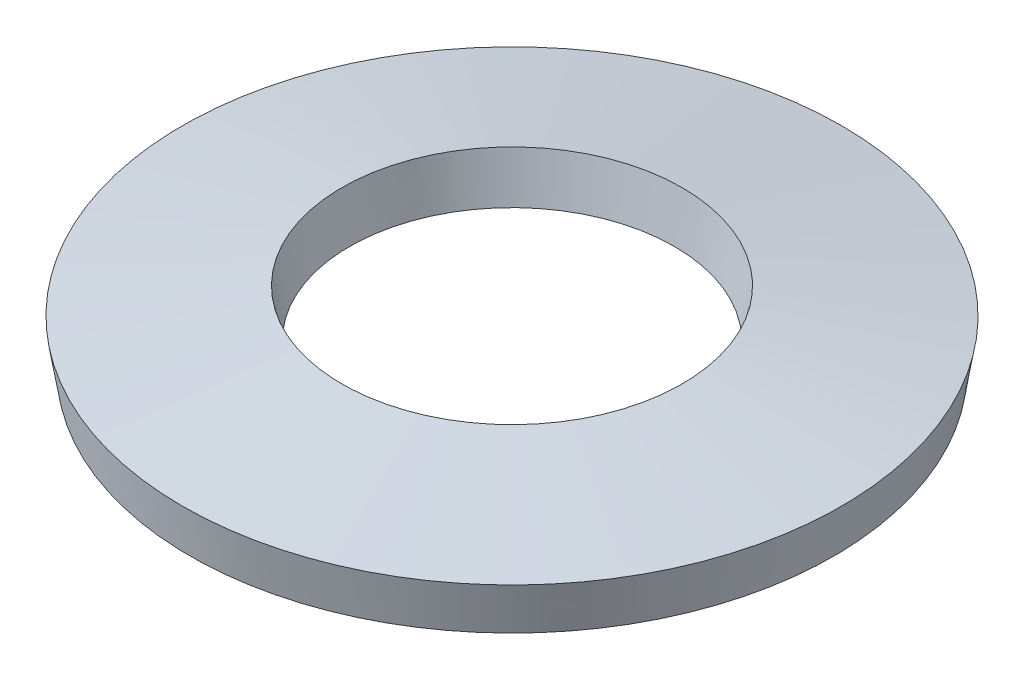
ISO-10303-21;
HEADER;
FILE_DESCRIPTION(('STEP AP214'),'2;1');
FILE_NAME('part.step','',(''),(''),'','','');
FILE_SCHEMA(('AUTOMOTIVE_DESIGN { 1 0 10303 214 1 1 1 1 }'));
ENDSEC;
DATA;
#1=APPLICATION_CONTEXT('core data for automotive mechanical design processes');
#2=APPLICATION_PROTOCOL_DEFINITION('international standard','automotive_design',2000,#1);
#3=PRODUCT_CONTEXT('',#1,'mechanical');
#4=PRODUCT('Part','Part','',(#3));
#5=PRODUCT_RELATED_PRODUCT_CATEGORY('part','',(#4));
#6=PRODUCT_DEFINITION_FORMATION('','',#4);
#7=PRODUCT_DEFINITION_CONTEXT('part definition',#1,'design');
#8=PRODUCT_DEFINITION('design','',#6,#7);
#9=PRODUCT_DEFINITION_SHAPE('','',#8);
#10=(LENGTH_UNIT() NAMED_UNIT(*) SI_UNIT(.MILLI.,.METRE.));
#11=(NAMED_UNIT(*) PLANE_ANGLE_UNIT() SI_UNIT($,.RADIAN.));
#12=(NAMED_UNIT(*) SI_UNIT($,.STERADIAN.) SOLID_ANGLE_UNIT());
#13=UNCERTAINTY_MEASURE_WITH_UNIT(LENGTH_MEASURE(1.E-05),#10,'distance_accuracy_value','');
#14=(GEOMETRIC_REPRESENTATION_CONTEXT(3) GLOBAL_UNCERTAINTY_ASSIGNED_CONTEXT((#13)) GLOBAL_UNIT_ASSIGNED_CONTEXT((#10,
#11,#12)) REPRESENTATION_CONTEXT('',''));
#15=CARTESIAN_POINT('',(0.,0.,0.));
#16=DIRECTION('',(0.,0.,1.));
#17=DIRECTION('',(1.,0.,0.));
#18=AXIS2_PLACEMENT_3D('',#15,#16,#17);
#19=CARTESIAN_POINT('',(0.,0.,0.));
#20=DIRECTION('',(0.,1.,0.));
#21=DIRECTION('',(0.,0.,1.));
#22=AXIS2_PLACEMENT_3D('',#19,#20,#21);
#23=CONICAL_SURFACE('',#22,10.1076923527169,0.162249360266415);
#24=CARTESIAN_POINT('',(0.,1.48029963320543,0.));
#25=DIRECTION('',(0.,-1.,0.));
#26=DIRECTION('',(0.,0.,-1.));
#27=AXIS2_PLACEMENT_3D('',#24,#25,#26);
#28=CIRCLE('',#27,10.35);
#29=CARTESIAN_POINT('',(0.,1.48029963320543,-10.35));
#30=VERTEX_POINT('',#29);
#31=EDGE_CURVE('E48',#30,#30,#28,.T.);
#32=ORIENTED_EDGE('',*,*,#31,.T.);
#33=EDGE_LOOP('',(#32));
#34=FACE_BOUND('',#33,.T.);
#35=CARTESIAN_POINT('',(0.,0.,0.));
#36=DIRECTION('',(0.,-1.,0.));
#37=DIRECTION('',(0.,0.,-1.));
#38=AXIS2_PLACEMENT_3D('',#35,#36,#37);
#39=CIRCLE('',#38,10.1076923527169);
#40=CARTESIAN_POINT('',(0.,0.,-10.1076923527169));
#41=VERTEX_POINT('',#40);
#42=EDGE_CURVE('E10',#41,#41,#39,.T.);
#43=ORIENTED_EDGE('',*,*,#42,.F.);
#44=EDGE_LOOP('',(#43));
#45=FACE_BOUND('',#44,.T.);
#46=ADVANCED_FACE('F34',(#34,#45),#23,.T.);
#47=CARTESIAN_POINT('',(0.,0.819700366794565,0.));
#48=DIRECTION('',(0.,-1.,0.));
#49=DIRECTION('',(0.,0.,-1.));
#50=AXIS2_PLACEMENT_3D('',#47,#48,#49);
#51=CONICAL_SURFACE('',#50,5.1,1.40854696652847);
#52=ORIENTED_EDGE('',*,*,#42,.T.);
#53=EDGE_LOOP('',(#52));
#54=FACE_BOUND('',#53,.T.);
#55=CARTESIAN_POINT('',(0.,0.819700366794565,0.));
#56=DIRECTION('',(0.,-1.,0.));
#57=DIRECTION('',(0.,0.,-1.));
#58=AXIS2_PLACEMENT_3D('',#55,#56,#57);
#59=CIRCLE('',#58,5.1);
#60=CARTESIAN_POINT('',(0.,0.819700366794565,-5.1));
#61=VERTEX_POINT('',#60);
#62=EDGE_CURVE('E40',#61,#61,#59,.T.);
#63=ORIENTED_EDGE('',*,*,#62,.F.);
#64=EDGE_LOOP('',(#63));
#65=FACE_BOUND('',#64,.T.);
#66=ADVANCED_FACE('F64',(#54,#65),#51,.F.);
#67=CARTESIAN_POINT('',(0.,2.3,0.));
#68=DIRECTION('',(0.,1.,0.));
#69=DIRECTION('',(0.,0.,1.));
#70=AXIS2_PLACEMENT_3D('',#67,#68,#69);
#71=CONICAL_SURFACE('',#70,5.34230764728308,0.162249360266415);
#72=ORIENTED_EDGE('',*,*,#62,.T.);
#73=EDGE_LOOP('',(#72));
#74=FACE_BOUND('',#73,.T.);
#75=CARTESIAN_POINT('',(0.,2.3,0.));
#76=DIRECTION('',(0.,-1.,0.));
#77=DIRECTION('',(0.,0.,-1.));
#78=AXIS2_PLACEMENT_3D('',#75,#76,#77);
#79=CIRCLE('',#78,5.34230764728308);
#80=CARTESIAN_POINT('',(0.,2.3,-5.34230764728308));
#81=VERTEX_POINT('',#80);
#82=EDGE_CURVE('E44',#81,#81,#79,.T.);
#83=ORIENTED_EDGE('',*,*,#82,.F.);
#84=EDGE_LOOP('',(#83));
#85=FACE_BOUND('',#84,.T.);
#86=ADVANCED_FACE('F58',(#74,#85),#71,.F.);
#87=CARTESIAN_POINT('',(0.,1.48029963320543,0.));
#88=DIRECTION('',(0.,-1.,0.));
#89=DIRECTION('',(0.,0.,-1.));
#90=AXIS2_PLACEMENT_3D('',#87,#88,#89);
#91=CONICAL_SURFACE('',#90,10.35,1.40854696652847);
#92=ORIENTED_EDGE('',*,*,#82,.T.);
#93=EDGE_LOOP('',(#92));
#94=FACE_BOUND('',#93,.T.);
#95=ORIENTED_EDGE('',*,*,#31,.F.);
#96=EDGE_LOOP('',(#95));
#97=FACE_BOUND('',#96,.T.);
#98=ADVANCED_FACE('F56',(#94,#97),#91,.T.);
#99=CLOSED_SHELL('',(#46,#66,#86,#98));
#100=MANIFOLD_SOLID_BREP('B2',#99);
#101=ADVANCED_BREP_SHAPE_REPRESENTATION('',(#18,#100),#14);
#102=SHAPE_DEFINITION_REPRESENTATION(#9,#101);
ENDSEC;
END-ISO-10303-21;
